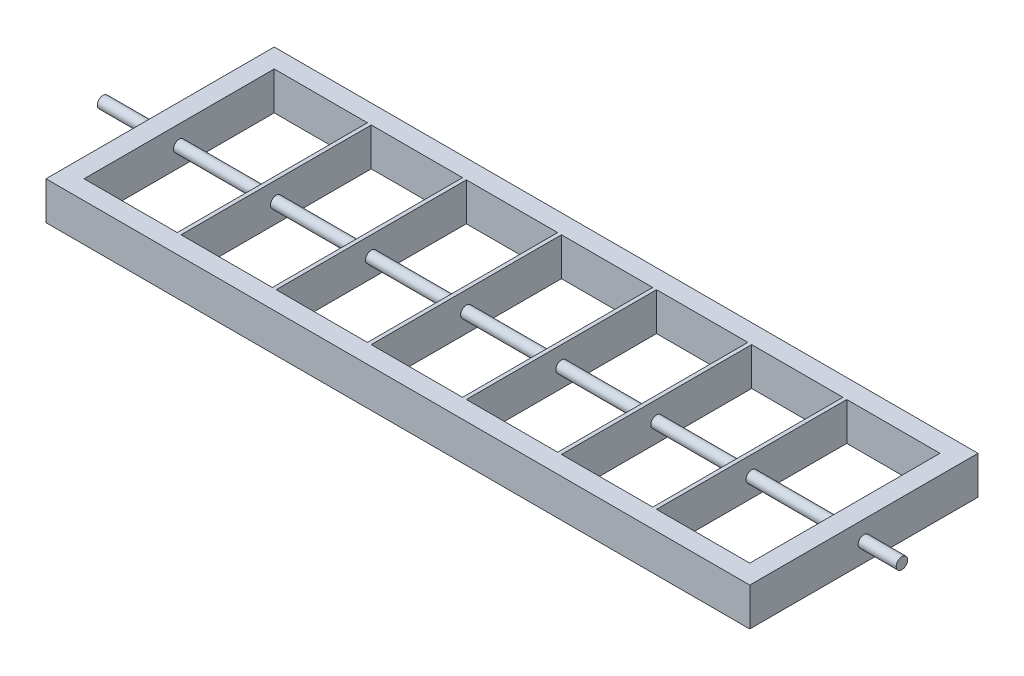
ISO-10303-21;
HEADER;
FILE_DESCRIPTION(('STEP AP214'),'2;1');
FILE_NAME('part.step','',(''),(''),'','','');
FILE_SCHEMA(('AUTOMOTIVE_DESIGN { 1 0 10303 214 1 1 1 1 }'));
ENDSEC;
DATA;
#1=APPLICATION_CONTEXT('core data for automotive mechanical design processes');
#2=APPLICATION_PROTOCOL_DEFINITION('international standard','automotive_design',2000,#1);
#3=PRODUCT_CONTEXT('',#1,'mechanical');
#4=PRODUCT('Part','Part','',(#3));
#5=PRODUCT_RELATED_PRODUCT_CATEGORY('part','',(#4));
#6=PRODUCT_DEFINITION_FORMATION('','',#4);
#7=PRODUCT_DEFINITION_CONTEXT('part definition',#1,'design');
#8=PRODUCT_DEFINITION('design','',#6,#7);
#9=PRODUCT_DEFINITION_SHAPE('','',#8);
#10=(LENGTH_UNIT() NAMED_UNIT(*) SI_UNIT(.MILLI.,.METRE.));
#11=(NAMED_UNIT(*) PLANE_ANGLE_UNIT() SI_UNIT($,.RADIAN.));
#12=(NAMED_UNIT(*) SI_UNIT($,.STERADIAN.) SOLID_ANGLE_UNIT());
#13=UNCERTAINTY_MEASURE_WITH_UNIT(LENGTH_MEASURE(1.E-05),#10,'distance_accuracy_value','');
#14=(GEOMETRIC_REPRESENTATION_CONTEXT(3) GLOBAL_UNCERTAINTY_ASSIGNED_CONTEXT((#13)) GLOBAL_UNIT_ASSIGNED_CONTEXT((#10,
#11,#12)) REPRESENTATION_CONTEXT('',''));
#15=CARTESIAN_POINT('',(0.,0.,0.));
#16=DIRECTION('',(0.,0.,1.));
#17=DIRECTION('',(1.,0.,0.));
#18=AXIS2_PLACEMENT_3D('',#15,#16,#17);
#19=CARTESIAN_POINT('',(-175.,20.,50.));
#20=DIRECTION('',(0.,0.,-1.));
#21=DIRECTION('',(-1.,0.,0.));
#22=AXIS2_PLACEMENT_3D('',#19,#20,#21);
#23=PLANE('',#22);
#24=DIRECTION('',(1.,0.,0.));
#25=VECTOR('',#24,1.);
#26=CARTESIAN_POINT('',(-175.,0.,50.));
#27=LINE('',#26,#25);
#28=CARTESIAN_POINT('',(-124.,0.,50.));
#29=VERTEX_POINT('',#28);
#30=CARTESIAN_POINT('',(-76.,0.,50.));
#31=VERTEX_POINT('',#30);
#32=EDGE_CURVE('E56',#29,#31,#27,.T.);
#33=ORIENTED_EDGE('',*,*,#32,.F.);
#34=DIRECTION('',(0.,-1.,0.));
#35=VECTOR('',#34,1.);
#36=CARTESIAN_POINT('',(-124.,0.,50.));
#37=LINE('',#36,#35);
#38=CARTESIAN_POINT('',(-124.,20.,50.));
#39=VERTEX_POINT('',#38);
#40=EDGE_CURVE('E51',#39,#29,#37,.T.);
#41=ORIENTED_EDGE('',*,*,#40,.F.);
#42=DIRECTION('',(1.,0.,0.));
#43=VECTOR('',#42,1.);
#44=CARTESIAN_POINT('',(-175.,20.,50.));
#45=LINE('',#44,#43);
#46=CARTESIAN_POINT('',(-76.,20.,50.));
#47=VERTEX_POINT('',#46);
#48=EDGE_CURVE('E255',#39,#47,#45,.T.);
#49=ORIENTED_EDGE('',*,*,#48,.T.);
#50=DIRECTION('',(0.,-1.,0.));
#51=VECTOR('',#50,1.);
#52=CARTESIAN_POINT('',(-76.,0.,50.));
#53=LINE('',#52,#51);
#54=EDGE_CURVE('E290',#47,#31,#53,.T.);
#55=ORIENTED_EDGE('',*,*,#54,.T.);
#56=EDGE_LOOP('',(#33,#41,#49,#55));
#57=FACE_BOUND('',#56,.T.);
#58=ADVANCED_FACE('F35',(#57),#23,.T.);
#59=CARTESIAN_POINT('',(-175.,20.,-50.));
#60=DIRECTION('',(0.,0.,1.));
#61=DIRECTION('',(1.,0.,0.));
#62=AXIS2_PLACEMENT_3D('',#59,#60,#61);
#63=PLANE('',#62);
#64=DIRECTION('',(-1.,0.,0.));
#65=VECTOR('',#64,1.);
#66=CARTESIAN_POINT('',(-175.,20.,-50.));
#67=LINE('',#66,#65);
#68=CARTESIAN_POINT('',(-76.,20.,-50.));
#69=VERTEX_POINT('',#68);
#70=CARTESIAN_POINT('',(-124.,20.,-50.));
#71=VERTEX_POINT('',#70);
#72=EDGE_CURVE('E538',#69,#71,#67,.T.);
#73=ORIENTED_EDGE('',*,*,#72,.T.);
#74=DIRECTION('',(0.,1.,0.));
#75=VECTOR('',#74,1.);
#76=CARTESIAN_POINT('',(-124.,0.,-50.));
#77=LINE('',#76,#75);
#78=CARTESIAN_POINT('',(-124.,0.,-50.));
#79=VERTEX_POINT('',#78);
#80=EDGE_CURVE('E265',#79,#71,#77,.T.);
#81=ORIENTED_EDGE('',*,*,#80,.F.);
#82=DIRECTION('',(-1.,0.,0.));
#83=VECTOR('',#82,1.);
#84=CARTESIAN_POINT('',(-175.,0.,-50.));
#85=LINE('',#84,#83);
#86=CARTESIAN_POINT('',(-76.,0.,-50.));
#87=VERTEX_POINT('',#86);
#88=EDGE_CURVE('E524',#87,#79,#85,.T.);
#89=ORIENTED_EDGE('',*,*,#88,.F.);
#90=DIRECTION('',(0.,1.,0.));
#91=VECTOR('',#90,1.);
#92=CARTESIAN_POINT('',(-76.,0.,-50.));
#93=LINE('',#92,#91);
#94=EDGE_CURVE('E286',#87,#69,#93,.T.);
#95=ORIENTED_EDGE('',*,*,#94,.T.);
#96=EDGE_LOOP('',(#73,#81,#89,#95));
#97=FACE_BOUND('',#96,.T.);
#98=ADVANCED_FACE('F611',(#97),#63,.T.);
#99=CARTESIAN_POINT('',(205.,10.,0.));
#100=DIRECTION('',(-1.,0.,0.));
#101=DIRECTION('',(0.,0.,1.));
#102=AXIS2_PLACEMENT_3D('',#99,#100,#101);
#103=CYLINDRICAL_SURFACE('',#102,3.);
#104=CARTESIAN_POINT('',(-76.,10.,0.));
#105=DIRECTION('',(-1.,0.,0.));
#106=DIRECTION('',(0.,0.,1.));
#107=AXIS2_PLACEMENT_3D('',#104,#105,#106);
#108=CIRCLE('',#107,3.);
#109=CARTESIAN_POINT('',(-76.,10.,3.));
#110=VERTEX_POINT('',#109);
#111=EDGE_CURVE('E44',#110,#110,#108,.F.);
#112=ORIENTED_EDGE('',*,*,#111,.F.);
#113=EDGE_LOOP('',(#112));
#114=FACE_BOUND('',#113,.T.);
#115=CARTESIAN_POINT('',(-124.,10.,0.));
#116=DIRECTION('',(-1.,0.,0.));
#117=DIRECTION('',(0.,0.,1.));
#118=AXIS2_PLACEMENT_3D('',#115,#116,#117);
#119=CIRCLE('',#118,3.);
#120=CARTESIAN_POINT('',(-124.,10.,3.));
#121=VERTEX_POINT('',#120);
#122=EDGE_CURVE('E39',#121,#121,#119,.F.);
#123=ORIENTED_EDGE('',*,*,#122,.T.);
#124=EDGE_LOOP('',(#123));
#125=FACE_BOUND('',#124,.T.);
#126=ADVANCED_FACE('F620',(#114,#125),#103,.T.);
#127=CARTESIAN_POINT('',(-74.,0.,50.));
#128=VERTEX_POINT('',#127);
#129=CARTESIAN_POINT('',(-26.,0.,50.));
#130=VERTEX_POINT('',#129);
#131=EDGE_CURVE('E519',#128,#130,#27,.T.);
#132=ORIENTED_EDGE('',*,*,#131,.F.);
#133=DIRECTION('',(0.,-1.,0.));
#134=VECTOR('',#133,1.);
#135=CARTESIAN_POINT('',(-74.,0.,50.));
#136=LINE('',#135,#134);
#137=CARTESIAN_POINT('',(-74.,20.,50.));
#138=VERTEX_POINT('',#137);
#139=EDGE_CURVE('E292',#138,#128,#136,.T.);
#140=ORIENTED_EDGE('',*,*,#139,.F.);
#141=CARTESIAN_POINT('',(-26.,20.,50.));
#142=VERTEX_POINT('',#141);
#143=EDGE_CURVE('E587',#138,#142,#45,.T.);
#144=ORIENTED_EDGE('',*,*,#143,.T.);
#145=DIRECTION('',(0.,-1.,0.));
#146=VECTOR('',#145,1.);
#147=CARTESIAN_POINT('',(-26.,0.,50.));
#148=LINE('',#147,#146);
#149=EDGE_CURVE('E313',#142,#130,#148,.T.);
#150=ORIENTED_EDGE('',*,*,#149,.T.);
#151=EDGE_LOOP('',(#132,#140,#144,#150));
#152=FACE_BOUND('',#151,.T.);
#153=ADVANCED_FACE('F634',(#152),#23,.T.);
#154=CARTESIAN_POINT('',(-26.,20.,-50.));
#155=VERTEX_POINT('',#154);
#156=CARTESIAN_POINT('',(-74.,20.,-50.));
#157=VERTEX_POINT('',#156);
#158=EDGE_CURVE('E539',#155,#157,#67,.T.);
#159=ORIENTED_EDGE('',*,*,#158,.T.);
#160=DIRECTION('',(0.,1.,0.));
#161=VECTOR('',#160,1.);
#162=CARTESIAN_POINT('',(-74.,0.,-50.));
#163=LINE('',#162,#161);
#164=CARTESIAN_POINT('',(-74.,0.,-50.));
#165=VERTEX_POINT('',#164);
#166=EDGE_CURVE('E283',#165,#157,#163,.T.);
#167=ORIENTED_EDGE('',*,*,#166,.F.);
#168=CARTESIAN_POINT('',(-26.,0.,-50.));
#169=VERTEX_POINT('',#168);
#170=EDGE_CURVE('E520',#169,#165,#85,.T.);
#171=ORIENTED_EDGE('',*,*,#170,.F.);
#172=DIRECTION('',(0.,1.,0.));
#173=VECTOR('',#172,1.);
#174=CARTESIAN_POINT('',(-26.,0.,-50.));
#175=LINE('',#174,#173);
#176=EDGE_CURVE('E309',#169,#155,#175,.T.);
#177=ORIENTED_EDGE('',*,*,#176,.T.);
#178=EDGE_LOOP('',(#159,#167,#171,#177));
#179=FACE_BOUND('',#178,.T.);
#180=ADVANCED_FACE('F639',(#179),#63,.T.);
#181=CARTESIAN_POINT('',(-26.,10.,0.));
#182=DIRECTION('',(-1.,0.,0.));
#183=DIRECTION('',(0.,0.,1.));
#184=AXIS2_PLACEMENT_3D('',#181,#182,#183);
#185=CIRCLE('',#184,3.);
#186=CARTESIAN_POINT('',(-26.,10.,3.));
#187=VERTEX_POINT('',#186);
#188=EDGE_CURVE('E493',#187,#187,#185,.F.);
#189=ORIENTED_EDGE('',*,*,#188,.F.);
#190=EDGE_LOOP('',(#189));
#191=FACE_BOUND('',#190,.T.);
#192=CARTESIAN_POINT('',(-74.,10.,0.));
#193=DIRECTION('',(-1.,0.,0.));
#194=DIRECTION('',(0.,0.,1.));
#195=AXIS2_PLACEMENT_3D('',#192,#193,#194);
#196=CIRCLE('',#195,3.);
#197=CARTESIAN_POINT('',(-74.,10.,3.));
#198=VERTEX_POINT('',#197);
#199=EDGE_CURVE('E289',#198,#198,#196,.F.);
#200=ORIENTED_EDGE('',*,*,#199,.T.);
#201=EDGE_LOOP('',(#200));
#202=FACE_BOUND('',#201,.T.);
#203=ADVANCED_FACE('F505',(#191,#202),#103,.T.);
#204=CARTESIAN_POINT('',(-24.,0.,50.));
#205=VERTEX_POINT('',#204);
#206=CARTESIAN_POINT('',(24.,0.,50.));
#207=VERTEX_POINT('',#206);
#208=EDGE_CURVE('E605',#205,#207,#27,.T.);
#209=ORIENTED_EDGE('',*,*,#208,.F.);
#210=DIRECTION('',(0.,-1.,0.));
#211=VECTOR('',#210,1.);
#212=CARTESIAN_POINT('',(-24.,0.,50.));
#213=LINE('',#212,#211);
#214=CARTESIAN_POINT('',(-24.,20.,50.));
#215=VERTEX_POINT('',#214);
#216=EDGE_CURVE('E316',#215,#205,#213,.T.);
#217=ORIENTED_EDGE('',*,*,#216,.F.);
#218=CARTESIAN_POINT('',(24.,20.,50.));
#219=VERTEX_POINT('',#218);
#220=EDGE_CURVE('E586',#215,#219,#45,.T.);
#221=ORIENTED_EDGE('',*,*,#220,.T.);
#222=DIRECTION('',(0.,-1.,0.));
#223=VECTOR('',#222,1.);
#224=CARTESIAN_POINT('',(24.,0.,50.));
#225=LINE('',#224,#223);
#226=EDGE_CURVE('E337',#219,#207,#225,.T.);
#227=ORIENTED_EDGE('',*,*,#226,.T.);
#228=EDGE_LOOP('',(#209,#217,#221,#227));
#229=FACE_BOUND('',#228,.T.);
#230=ADVANCED_FACE('F644',(#229),#23,.T.);
#231=CARTESIAN_POINT('',(24.,20.,-50.));
#232=VERTEX_POINT('',#231);
#233=CARTESIAN_POINT('',(-24.,20.,-50.));
#234=VERTEX_POINT('',#233);
#235=EDGE_CURVE('E543',#232,#234,#67,.T.);
#236=ORIENTED_EDGE('',*,*,#235,.T.);
#237=DIRECTION('',(0.,1.,0.));
#238=VECTOR('',#237,1.);
#239=CARTESIAN_POINT('',(-24.,0.,-50.));
#240=LINE('',#239,#238);
#241=CARTESIAN_POINT('',(-24.,0.,-50.));
#242=VERTEX_POINT('',#241);
#243=EDGE_CURVE('E306',#242,#234,#240,.T.);
#244=ORIENTED_EDGE('',*,*,#243,.F.);
#245=CARTESIAN_POINT('',(24.,0.,-50.));
#246=VERTEX_POINT('',#245);
#247=EDGE_CURVE('E523',#246,#242,#85,.T.);
#248=ORIENTED_EDGE('',*,*,#247,.F.);
#249=DIRECTION('',(0.,1.,0.));
#250=VECTOR('',#249,1.);
#251=CARTESIAN_POINT('',(24.,0.,-50.));
#252=LINE('',#251,#250);
#253=EDGE_CURVE('E333',#246,#232,#252,.T.);
#254=ORIENTED_EDGE('',*,*,#253,.T.);
#255=EDGE_LOOP('',(#236,#244,#248,#254));
#256=FACE_BOUND('',#255,.T.);
#257=ADVANCED_FACE('F677',(#256),#63,.T.);
#258=CARTESIAN_POINT('',(24.,10.,0.));
#259=DIRECTION('',(-1.,0.,0.));
#260=DIRECTION('',(0.,0.,1.));
#261=AXIS2_PLACEMENT_3D('',#258,#259,#260);
#262=CIRCLE('',#261,3.);
#263=CARTESIAN_POINT('',(24.,10.,3.));
#264=VERTEX_POINT('',#263);
#265=EDGE_CURVE('E488',#264,#264,#262,.F.);
#266=ORIENTED_EDGE('',*,*,#265,.F.);
#267=EDGE_LOOP('',(#266));
#268=FACE_BOUND('',#267,.T.);
#269=CARTESIAN_POINT('',(-24.,10.,0.));
#270=DIRECTION('',(-1.,0.,0.));
#271=DIRECTION('',(0.,0.,1.));
#272=AXIS2_PLACEMENT_3D('',#269,#270,#271);
#273=CIRCLE('',#272,3.);
#274=CARTESIAN_POINT('',(-24.,10.,3.));
#275=VERTEX_POINT('',#274);
#276=EDGE_CURVE('E312',#275,#275,#273,.F.);
#277=ORIENTED_EDGE('',*,*,#276,.T.);
#278=EDGE_LOOP('',(#277));
#279=FACE_BOUND('',#278,.T.);
#280=ADVANCED_FACE('F671',(#268,#279),#103,.T.);
#281=CARTESIAN_POINT('',(26.,0.,50.));
#282=VERTEX_POINT('',#281);
#283=CARTESIAN_POINT('',(74.,0.,50.));
#284=VERTEX_POINT('',#283);
#285=EDGE_CURVE('E582',#282,#284,#27,.T.);
#286=ORIENTED_EDGE('',*,*,#285,.F.);
#287=DIRECTION('',(0.,-1.,0.));
#288=VECTOR('',#287,1.);
#289=CARTESIAN_POINT('',(26.,0.,50.));
#290=LINE('',#289,#288);
#291=CARTESIAN_POINT('',(26.,20.,50.));
#292=VERTEX_POINT('',#291);
#293=EDGE_CURVE('E340',#292,#282,#290,.T.);
#294=ORIENTED_EDGE('',*,*,#293,.F.);
#295=CARTESIAN_POINT('',(74.,20.,50.));
#296=VERTEX_POINT('',#295);
#297=EDGE_CURVE('E581',#292,#296,#45,.T.);
#298=ORIENTED_EDGE('',*,*,#297,.T.);
#299=DIRECTION('',(0.,-1.,0.));
#300=VECTOR('',#299,1.);
#301=CARTESIAN_POINT('',(74.,0.,50.));
#302=LINE('',#301,#300);
#303=EDGE_CURVE('E361',#296,#284,#302,.T.);
#304=ORIENTED_EDGE('',*,*,#303,.T.);
#305=EDGE_LOOP('',(#286,#294,#298,#304));
#306=FACE_BOUND('',#305,.T.);
#307=ADVANCED_FACE('F580',(#306),#23,.T.);
#308=CARTESIAN_POINT('',(74.,20.,-50.));
#309=VERTEX_POINT('',#308);
#310=CARTESIAN_POINT('',(26.,20.,-50.));
#311=VERTEX_POINT('',#310);
#312=EDGE_CURVE('E546',#309,#311,#67,.T.);
#313=ORIENTED_EDGE('',*,*,#312,.T.);
#314=DIRECTION('',(0.,1.,0.));
#315=VECTOR('',#314,1.);
#316=CARTESIAN_POINT('',(26.,0.,-50.));
#317=LINE('',#316,#315);
#318=CARTESIAN_POINT('',(26.,0.,-50.));
#319=VERTEX_POINT('',#318);
#320=EDGE_CURVE('E330',#319,#311,#317,.T.);
#321=ORIENTED_EDGE('',*,*,#320,.F.);
#322=CARTESIAN_POINT('',(74.,0.,-50.));
#323=VERTEX_POINT('',#322);
#324=EDGE_CURVE('E526',#323,#319,#85,.T.);
#325=ORIENTED_EDGE('',*,*,#324,.F.);
#326=DIRECTION('',(0.,1.,0.));
#327=VECTOR('',#326,1.);
#328=CARTESIAN_POINT('',(74.,0.,-50.));
#329=LINE('',#328,#327);
#330=EDGE_CURVE('E357',#323,#309,#329,.T.);
#331=ORIENTED_EDGE('',*,*,#330,.T.);
#332=EDGE_LOOP('',(#313,#321,#325,#331));
#333=FACE_BOUND('',#332,.T.);
#334=ADVANCED_FACE('F669',(#333),#63,.T.);
#335=CARTESIAN_POINT('',(74.,10.,0.));
#336=DIRECTION('',(-1.,0.,0.));
#337=DIRECTION('',(0.,0.,1.));
#338=AXIS2_PLACEMENT_3D('',#335,#336,#337);
#339=CIRCLE('',#338,3.);
#340=CARTESIAN_POINT('',(74.,10.,3.));
#341=VERTEX_POINT('',#340);
#342=EDGE_CURVE('E483',#341,#341,#339,.F.);
#343=ORIENTED_EDGE('',*,*,#342,.F.);
#344=EDGE_LOOP('',(#343));
#345=FACE_BOUND('',#344,.T.);
#346=CARTESIAN_POINT('',(26.,10.,0.));
#347=DIRECTION('',(-1.,0.,0.));
#348=DIRECTION('',(0.,0.,1.));
#349=AXIS2_PLACEMENT_3D('',#346,#347,#348);
#350=CIRCLE('',#349,3.);
#351=CARTESIAN_POINT('',(26.,10.,3.));
#352=VERTEX_POINT('',#351);
#353=EDGE_CURVE('E336',#352,#352,#350,.F.);
#354=ORIENTED_EDGE('',*,*,#353,.T.);
#355=EDGE_LOOP('',(#354));
#356=FACE_BOUND('',#355,.T.);
#357=ADVANCED_FACE('F663',(#345,#356),#103,.T.);
#358=CARTESIAN_POINT('',(76.,0.,50.));
#359=VERTEX_POINT('',#358);
#360=CARTESIAN_POINT('',(124.,0.,50.));
#361=VERTEX_POINT('',#360);
#362=EDGE_CURVE('E570',#359,#361,#27,.T.);
#363=ORIENTED_EDGE('',*,*,#362,.F.);
#364=DIRECTION('',(0.,-1.,0.));
#365=VECTOR('',#364,1.);
#366=CARTESIAN_POINT('',(76.,0.,50.));
#367=LINE('',#366,#365);
#368=CARTESIAN_POINT('',(76.,20.,50.));
#369=VERTEX_POINT('',#368);
#370=EDGE_CURVE('E364',#369,#359,#367,.T.);
#371=ORIENTED_EDGE('',*,*,#370,.F.);
#372=CARTESIAN_POINT('',(124.,20.,50.));
#373=VERTEX_POINT('',#372);
#374=EDGE_CURVE('E563',#369,#373,#45,.T.);
#375=ORIENTED_EDGE('',*,*,#374,.T.);
#376=DIRECTION('',(0.,-1.,0.));
#377=VECTOR('',#376,1.);
#378=CARTESIAN_POINT('',(124.,0.,50.));
#379=LINE('',#378,#377);
#380=EDGE_CURVE('E385',#373,#361,#379,.T.);
#381=ORIENTED_EDGE('',*,*,#380,.T.);
#382=EDGE_LOOP('',(#363,#371,#375,#381));
#383=FACE_BOUND('',#382,.T.);
#384=ADVANCED_FACE('F655',(#383),#23,.T.);
#385=CARTESIAN_POINT('',(124.,20.,-50.));
#386=VERTEX_POINT('',#385);
#387=CARTESIAN_POINT('',(76.,20.,-50.));
#388=VERTEX_POINT('',#387);
#389=EDGE_CURVE('E428',#386,#388,#67,.T.);
#390=ORIENTED_EDGE('',*,*,#389,.T.);
#391=DIRECTION('',(0.,1.,0.));
#392=VECTOR('',#391,1.);
#393=CARTESIAN_POINT('',(76.,0.,-50.));
#394=LINE('',#393,#392);
#395=CARTESIAN_POINT('',(76.,0.,-50.));
#396=VERTEX_POINT('',#395);
#397=EDGE_CURVE('E354',#396,#388,#394,.T.);
#398=ORIENTED_EDGE('',*,*,#397,.F.);
#399=CARTESIAN_POINT('',(124.,0.,-50.));
#400=VERTEX_POINT('',#399);
#401=EDGE_CURVE('E440',#400,#396,#85,.T.);
#402=ORIENTED_EDGE('',*,*,#401,.F.);
#403=DIRECTION('',(0.,1.,0.));
#404=VECTOR('',#403,1.);
#405=CARTESIAN_POINT('',(124.,0.,-50.));
#406=LINE('',#405,#404);
#407=EDGE_CURVE('E381',#400,#386,#406,.T.);
#408=ORIENTED_EDGE('',*,*,#407,.T.);
#409=EDGE_LOOP('',(#390,#398,#402,#408));
#410=FACE_BOUND('',#409,.T.);
#411=ADVANCED_FACE('F556',(#410),#63,.T.);
#412=CARTESIAN_POINT('',(124.,10.,0.));
#413=DIRECTION('',(-1.,0.,0.));
#414=DIRECTION('',(0.,0.,1.));
#415=AXIS2_PLACEMENT_3D('',#412,#413,#414);
#416=CIRCLE('',#415,3.);
#417=CARTESIAN_POINT('',(124.,10.,3.));
#418=VERTEX_POINT('',#417);
#419=EDGE_CURVE('E412',#418,#418,#416,.F.);
#420=ORIENTED_EDGE('',*,*,#419,.F.);
#421=EDGE_LOOP('',(#420));
#422=FACE_BOUND('',#421,.T.);
#423=CARTESIAN_POINT('',(76.,10.,0.));
#424=DIRECTION('',(-1.,0.,0.));
#425=DIRECTION('',(0.,0.,1.));
#426=AXIS2_PLACEMENT_3D('',#423,#424,#425);
#427=CIRCLE('',#426,3.);
#428=CARTESIAN_POINT('',(76.,10.,3.));
#429=VERTEX_POINT('',#428);
#430=EDGE_CURVE('E360',#429,#429,#427,.F.);
#431=ORIENTED_EDGE('',*,*,#430,.T.);
#432=EDGE_LOOP('',(#431));
#433=FACE_BOUND('',#432,.T.);
#434=ADVANCED_FACE('F654',(#422,#433),#103,.T.);
#435=CARTESIAN_POINT('',(126.,0.,50.));
#436=VERTEX_POINT('',#435);
#437=CARTESIAN_POINT('',(175.,0.,50.));
#438=VERTEX_POINT('',#437);
#439=EDGE_CURVE('E431',#436,#438,#27,.T.);
#440=ORIENTED_EDGE('',*,*,#439,.F.);
#441=DIRECTION('',(0.,-1.,0.));
#442=VECTOR('',#441,1.);
#443=CARTESIAN_POINT('',(126.,0.,50.));
#444=LINE('',#443,#442);
#445=CARTESIAN_POINT('',(126.,20.,50.));
#446=VERTEX_POINT('',#445);
#447=EDGE_CURVE('E388',#446,#436,#444,.T.);
#448=ORIENTED_EDGE('',*,*,#447,.F.);
#449=CARTESIAN_POINT('',(175.,20.,50.));
#450=VERTEX_POINT('',#449);
#451=EDGE_CURVE('E257',#446,#450,#45,.T.);
#452=ORIENTED_EDGE('',*,*,#451,.T.);
#453=DIRECTION('',(0.,-1.,0.));
#454=VECTOR('',#453,1.);
#455=CARTESIAN_POINT('',(175.,20.,50.));
#456=LINE('',#455,#454);
#457=EDGE_CURVE('E445',#450,#438,#456,.T.);
#458=ORIENTED_EDGE('',*,*,#457,.T.);
#459=EDGE_LOOP('',(#440,#448,#452,#458));
#460=FACE_BOUND('',#459,.T.);
#461=ADVANCED_FACE('F592',(#460),#23,.T.);
#462=CARTESIAN_POINT('',(175.,20.,-50.));
#463=VERTEX_POINT('',#462);
#464=CARTESIAN_POINT('',(126.,20.,-50.));
#465=VERTEX_POINT('',#464);
#466=EDGE_CURVE('E425',#463,#465,#67,.T.);
#467=ORIENTED_EDGE('',*,*,#466,.T.);
#468=DIRECTION('',(0.,1.,0.));
#469=VECTOR('',#468,1.);
#470=CARTESIAN_POINT('',(126.,0.,-50.));
#471=LINE('',#470,#469);
#472=CARTESIAN_POINT('',(126.,0.,-50.));
#473=VERTEX_POINT('',#472);
#474=EDGE_CURVE('E378',#473,#465,#471,.T.);
#475=ORIENTED_EDGE('',*,*,#474,.F.);
#476=CARTESIAN_POINT('',(175.,0.,-50.));
#477=VERTEX_POINT('',#476);
#478=EDGE_CURVE('E421',#477,#473,#85,.T.);
#479=ORIENTED_EDGE('',*,*,#478,.F.);
#480=DIRECTION('',(0.,-1.,0.));
#481=VECTOR('',#480,1.);
#482=CARTESIAN_POINT('',(175.,20.,-50.));
#483=LINE('',#482,#481);
#484=EDGE_CURVE('E443',#463,#477,#483,.T.);
#485=ORIENTED_EDGE('',*,*,#484,.F.);
#486=EDGE_LOOP('',(#467,#475,#479,#485));
#487=FACE_BOUND('',#486,.T.);
#488=ADVANCED_FACE('F601',(#487),#63,.T.);
#489=CARTESIAN_POINT('',(175.,10.,0.));
#490=DIRECTION('',(-1.,0.,0.));
#491=DIRECTION('',(0.,0.,1.));
#492=AXIS2_PLACEMENT_3D('',#489,#490,#491);
#493=CIRCLE('',#492,3.);
#494=CARTESIAN_POINT('',(175.,10.,3.));
#495=VERTEX_POINT('',#494);
#496=EDGE_CURVE('E413',#495,#495,#493,.T.);
#497=ORIENTED_EDGE('',*,*,#496,.T.);
#498=EDGE_LOOP('',(#497));
#499=FACE_BOUND('',#498,.T.);
#500=CARTESIAN_POINT('',(126.,10.,0.));
#501=DIRECTION('',(-1.,0.,0.));
#502=DIRECTION('',(0.,0.,1.));
#503=AXIS2_PLACEMENT_3D('',#500,#501,#502);
#504=CIRCLE('',#503,3.);
#505=CARTESIAN_POINT('',(126.,10.,3.));
#506=VERTEX_POINT('',#505);
#507=EDGE_CURVE('E384',#506,#506,#504,.F.);
#508=ORIENTED_EDGE('',*,*,#507,.T.);
#509=EDGE_LOOP('',(#508));
#510=FACE_BOUND('',#509,.T.);
#511=ADVANCED_FACE('F660',(#499,#510),#103,.T.);
#512=CARTESIAN_POINT('',(0.,20.,0.));
#513=DIRECTION('',(0.,-1.,0.));
#514=DIRECTION('',(0.,0.,-1.));
#515=AXIS2_PLACEMENT_3D('',#512,#513,#514);
#516=PLANE('',#515);
#517=ORIENTED_EDGE('',*,*,#48,.F.);
#518=DIRECTION('',(0.,0.,1.));
#519=VECTOR('',#518,1.);
#520=CARTESIAN_POINT('',(-124.,20.,-70.0997512422418));
#521=LINE('',#520,#519);
#522=EDGE_CURVE('E266',#71,#39,#521,.T.);
#523=ORIENTED_EDGE('',*,*,#522,.F.);
#524=ORIENTED_EDGE('',*,*,#72,.F.);
#525=DIRECTION('',(0.,0.,1.));
#526=VECTOR('',#525,1.);
#527=CARTESIAN_POINT('',(-76.,20.,-70.0997512422418));
#528=LINE('',#527,#526);
#529=EDGE_CURVE('E287',#69,#47,#528,.T.);
#530=ORIENTED_EDGE('',*,*,#529,.T.);
#531=EDGE_LOOP('',(#517,#523,#524,#530));
#532=FACE_BOUND('',#531,.T.);
#533=ORIENTED_EDGE('',*,*,#143,.F.);
#534=DIRECTION('',(0.,0.,1.));
#535=VECTOR('',#534,1.);
#536=CARTESIAN_POINT('',(-74.,20.,-70.0997512422418));
#537=LINE('',#536,#535);
#538=EDGE_CURVE('E301',#157,#138,#537,.T.);
#539=ORIENTED_EDGE('',*,*,#538,.F.);
#540=ORIENTED_EDGE('',*,*,#158,.F.);
#541=DIRECTION('',(0.,0.,1.));
#542=VECTOR('',#541,1.);
#543=CARTESIAN_POINT('',(-26.,20.,-70.0997512422418));
#544=LINE('',#543,#542);
#545=EDGE_CURVE('E310',#155,#142,#544,.T.);
#546=ORIENTED_EDGE('',*,*,#545,.T.);
#547=EDGE_LOOP('',(#533,#539,#540,#546));
#548=FACE_BOUND('',#547,.T.);
#549=ORIENTED_EDGE('',*,*,#220,.F.);
#550=DIRECTION('',(0.,0.,1.));
#551=VECTOR('',#550,1.);
#552=CARTESIAN_POINT('',(-24.,20.,-70.0997512422418));
#553=LINE('',#552,#551);
#554=EDGE_CURVE('E325',#234,#215,#553,.T.);
#555=ORIENTED_EDGE('',*,*,#554,.F.);
#556=ORIENTED_EDGE('',*,*,#235,.F.);
#557=DIRECTION('',(0.,0.,1.));
#558=VECTOR('',#557,1.);
#559=CARTESIAN_POINT('',(24.,20.,-70.0997512422418));
#560=LINE('',#559,#558);
#561=EDGE_CURVE('E334',#232,#219,#560,.T.);
#562=ORIENTED_EDGE('',*,*,#561,.T.);
#563=EDGE_LOOP('',(#549,#555,#556,#562));
#564=FACE_BOUND('',#563,.T.);
#565=ORIENTED_EDGE('',*,*,#297,.F.);
#566=DIRECTION('',(0.,0.,1.));
#567=VECTOR('',#566,1.);
#568=CARTESIAN_POINT('',(26.,20.,-70.0997512422418));
#569=LINE('',#568,#567);
#570=EDGE_CURVE('E349',#311,#292,#569,.T.);
#571=ORIENTED_EDGE('',*,*,#570,.F.);
#572=ORIENTED_EDGE('',*,*,#312,.F.);
#573=DIRECTION('',(0.,0.,1.));
#574=VECTOR('',#573,1.);
#575=CARTESIAN_POINT('',(74.,20.,-70.0997512422418));
#576=LINE('',#575,#574);
#577=EDGE_CURVE('E358',#309,#296,#576,.T.);
#578=ORIENTED_EDGE('',*,*,#577,.T.);
#579=EDGE_LOOP('',(#565,#571,#572,#578));
#580=FACE_BOUND('',#579,.T.);
#581=ORIENTED_EDGE('',*,*,#374,.F.);
#582=DIRECTION('',(0.,0.,1.));
#583=VECTOR('',#582,1.);
#584=CARTESIAN_POINT('',(76.,20.,-70.0997512422418));
#585=LINE('',#584,#583);
#586=EDGE_CURVE('E373',#388,#369,#585,.T.);
#587=ORIENTED_EDGE('',*,*,#586,.F.);
#588=ORIENTED_EDGE('',*,*,#389,.F.);
#589=DIRECTION('',(0.,0.,1.));
#590=VECTOR('',#589,1.);
#591=CARTESIAN_POINT('',(124.,20.,-70.0997512422418));
#592=LINE('',#591,#590);
#593=EDGE_CURVE('E382',#386,#373,#592,.T.);
#594=ORIENTED_EDGE('',*,*,#593,.T.);
#595=EDGE_LOOP('',(#581,#587,#588,#594));
#596=FACE_BOUND('',#595,.T.);
#597=ORIENTED_EDGE('',*,*,#451,.F.);
#598=DIRECTION('',(0.,0.,1.));
#599=VECTOR('',#598,1.);
#600=CARTESIAN_POINT('',(126.,20.,-70.0997512422418));
#601=LINE('',#600,#599);
#602=EDGE_CURVE('E397',#465,#446,#601,.T.);
#603=ORIENTED_EDGE('',*,*,#602,.F.);
#604=ORIENTED_EDGE('',*,*,#466,.F.);
#605=DIRECTION('',(0.,0.,-1.));
#606=VECTOR('',#605,1.);
#607=CARTESIAN_POINT('',(175.,20.,50.));
#608=LINE('',#607,#606);
#609=EDGE_CURVE('E254',#450,#463,#608,.T.);
#610=ORIENTED_EDGE('',*,*,#609,.F.);
#611=EDGE_LOOP('',(#597,#603,#604,#610));
#612=FACE_BOUND('',#611,.T.);
#613=DIRECTION('',(0.,0.,-1.));
#614=VECTOR('',#613,1.);
#615=CARTESIAN_POINT('',(185.,20.,60.));
#616=LINE('',#615,#614);
#617=CARTESIAN_POINT('',(185.,20.,60.));
#618=VERTEX_POINT('',#617);
#619=CARTESIAN_POINT('',(185.,20.,-60.));
#620=VERTEX_POINT('',#619);
#621=EDGE_CURVE('E450',#618,#620,#616,.T.);
#622=ORIENTED_EDGE('',*,*,#621,.T.);
#623=DIRECTION('',(-1.,0.,0.));
#624=VECTOR('',#623,1.);
#625=CARTESIAN_POINT('',(-185.,20.,-60.));
#626=LINE('',#625,#624);
#627=CARTESIAN_POINT('',(-185.,20.,-60.));
#628=VERTEX_POINT('',#627);
#629=EDGE_CURVE('E453',#620,#628,#626,.T.);
#630=ORIENTED_EDGE('',*,*,#629,.T.);
#631=DIRECTION('',(0.,0.,1.));
#632=VECTOR('',#631,1.);
#633=CARTESIAN_POINT('',(-185.,20.,60.));
#634=LINE('',#633,#632);
#635=CARTESIAN_POINT('',(-185.,20.,60.));
#636=VERTEX_POINT('',#635);
#637=EDGE_CURVE('E456',#628,#636,#634,.T.);
#638=ORIENTED_EDGE('',*,*,#637,.T.);
#639=DIRECTION('',(1.,0.,0.));
#640=VECTOR('',#639,1.);
#641=CARTESIAN_POINT('',(-185.,20.,60.));
#642=LINE('',#641,#640);
#643=EDGE_CURVE('E458',#636,#618,#642,.T.);
#644=ORIENTED_EDGE('',*,*,#643,.T.);
#645=EDGE_LOOP('',(#622,#630,#638,#644));
#646=FACE_BOUND('',#645,.T.);
#647=DIRECTION('',(0.,0.,1.));
#648=VECTOR('',#647,1.);
#649=CARTESIAN_POINT('',(-175.,20.,50.));
#650=LINE('',#649,#648);
#651=CARTESIAN_POINT('',(-175.,20.,-50.));
#652=VERTEX_POINT('',#651);
#653=CARTESIAN_POINT('',(-175.,20.,50.));
#654=VERTEX_POINT('',#653);
#655=EDGE_CURVE('E420',#652,#654,#650,.T.);
#656=ORIENTED_EDGE('',*,*,#655,.F.);
#657=CARTESIAN_POINT('',(-126.,20.,-50.));
#658=VERTEX_POINT('',#657);
#659=EDGE_CURVE('E262',#658,#652,#67,.T.);
#660=ORIENTED_EDGE('',*,*,#659,.F.);
#661=DIRECTION('',(0.,0.,1.));
#662=VECTOR('',#661,1.);
#663=CARTESIAN_POINT('',(-126.,20.,-70.0997512422418));
#664=LINE('',#663,#662);
#665=CARTESIAN_POINT('',(-126.,20.,50.));
#666=VERTEX_POINT('',#665);
#667=EDGE_CURVE('E260',#658,#666,#664,.T.);
#668=ORIENTED_EDGE('',*,*,#667,.T.);
#669=EDGE_CURVE('E244',#654,#666,#45,.T.);
#670=ORIENTED_EDGE('',*,*,#669,.F.);
#671=EDGE_LOOP('',(#656,#660,#668,#670));
#672=FACE_BOUND('',#671,.T.);
#673=ADVANCED_FACE('F261',(#532,#548,#564,#580,#596,#612,#646,#672),#516,.F.);
#674=CARTESIAN_POINT('',(0.,0.,0.));
#675=DIRECTION('',(0.,-1.,0.));
#676=DIRECTION('',(0.,0.,-1.));
#677=AXIS2_PLACEMENT_3D('',#674,#675,#676);
#678=PLANE('',#677);
#679=CARTESIAN_POINT('',(-175.,0.,50.));
#680=VERTEX_POINT('',#679);
#681=CARTESIAN_POINT('',(-126.,0.,50.));
#682=VERTEX_POINT('',#681);
#683=EDGE_CURVE('E432',#680,#682,#27,.T.);
#684=ORIENTED_EDGE('',*,*,#683,.T.);
#685=DIRECTION('',(0.,0.,1.));
#686=VECTOR('',#685,1.);
#687=CARTESIAN_POINT('',(-126.,0.,-70.0997512422418));
#688=LINE('',#687,#686);
#689=CARTESIAN_POINT('',(-126.,0.,-50.));
#690=VERTEX_POINT('',#689);
#691=EDGE_CURVE('E271',#690,#682,#688,.T.);
#692=ORIENTED_EDGE('',*,*,#691,.F.);
#693=CARTESIAN_POINT('',(-175.,0.,-50.));
#694=VERTEX_POINT('',#693);
#695=EDGE_CURVE('E437',#690,#694,#85,.T.);
#696=ORIENTED_EDGE('',*,*,#695,.T.);
#697=DIRECTION('',(0.,0.,1.));
#698=VECTOR('',#697,1.);
#699=CARTESIAN_POINT('',(-175.,0.,50.));
#700=LINE('',#699,#698);
#701=EDGE_CURVE('E419',#694,#680,#700,.T.);
#702=ORIENTED_EDGE('',*,*,#701,.T.);
#703=EDGE_LOOP('',(#684,#692,#696,#702));
#704=FACE_BOUND('',#703,.T.);
#705=DIRECTION('',(0.,0.,1.));
#706=VECTOR('',#705,1.);
#707=CARTESIAN_POINT('',(-124.,0.,-70.0997512422418));
#708=LINE('',#707,#706);
#709=EDGE_CURVE('E279',#79,#29,#708,.T.);
#710=ORIENTED_EDGE('',*,*,#709,.T.);
#711=ORIENTED_EDGE('',*,*,#32,.T.);
#712=DIRECTION('',(0.,0.,1.));
#713=VECTOR('',#712,1.);
#714=CARTESIAN_POINT('',(-76.,0.,-70.0997512422418));
#715=LINE('',#714,#713);
#716=EDGE_CURVE('E295',#87,#31,#715,.T.);
#717=ORIENTED_EDGE('',*,*,#716,.F.);
#718=ORIENTED_EDGE('',*,*,#88,.T.);
#719=EDGE_LOOP('',(#710,#711,#717,#718));
#720=FACE_BOUND('',#719,.T.);
#721=DIRECTION('',(0.,0.,1.));
#722=VECTOR('',#721,1.);
#723=CARTESIAN_POINT('',(-74.,0.,-70.0997512422418));
#724=LINE('',#723,#722);
#725=EDGE_CURVE('E298',#165,#128,#724,.T.);
#726=ORIENTED_EDGE('',*,*,#725,.T.);
#727=ORIENTED_EDGE('',*,*,#131,.T.);
#728=DIRECTION('',(0.,0.,1.));
#729=VECTOR('',#728,1.);
#730=CARTESIAN_POINT('',(-26.,0.,-70.0997512422418));
#731=LINE('',#730,#729);
#732=EDGE_CURVE('E319',#169,#130,#731,.T.);
#733=ORIENTED_EDGE('',*,*,#732,.F.);
#734=ORIENTED_EDGE('',*,*,#170,.T.);
#735=EDGE_LOOP('',(#726,#727,#733,#734));
#736=FACE_BOUND('',#735,.T.);
#737=DIRECTION('',(0.,0.,1.));
#738=VECTOR('',#737,1.);
#739=CARTESIAN_POINT('',(-24.,0.,-70.0997512422418));
#740=LINE('',#739,#738);
#741=EDGE_CURVE('E322',#242,#205,#740,.T.);
#742=ORIENTED_EDGE('',*,*,#741,.T.);
#743=ORIENTED_EDGE('',*,*,#208,.T.);
#744=DIRECTION('',(0.,0.,1.));
#745=VECTOR('',#744,1.);
#746=CARTESIAN_POINT('',(24.,0.,-70.0997512422418));
#747=LINE('',#746,#745);
#748=EDGE_CURVE('E343',#246,#207,#747,.T.);
#749=ORIENTED_EDGE('',*,*,#748,.F.);
#750=ORIENTED_EDGE('',*,*,#247,.T.);
#751=EDGE_LOOP('',(#742,#743,#749,#750));
#752=FACE_BOUND('',#751,.T.);
#753=DIRECTION('',(0.,0.,1.));
#754=VECTOR('',#753,1.);
#755=CARTESIAN_POINT('',(26.,0.,-70.0997512422418));
#756=LINE('',#755,#754);
#757=EDGE_CURVE('E346',#319,#282,#756,.T.);
#758=ORIENTED_EDGE('',*,*,#757,.T.);
#759=ORIENTED_EDGE('',*,*,#285,.T.);
#760=DIRECTION('',(0.,0.,1.));
#761=VECTOR('',#760,1.);
#762=CARTESIAN_POINT('',(74.,0.,-70.0997512422418));
#763=LINE('',#762,#761);
#764=EDGE_CURVE('E367',#323,#284,#763,.T.);
#765=ORIENTED_EDGE('',*,*,#764,.F.);
#766=ORIENTED_EDGE('',*,*,#324,.T.);
#767=EDGE_LOOP('',(#758,#759,#765,#766));
#768=FACE_BOUND('',#767,.T.);
#769=DIRECTION('',(0.,0.,1.));
#770=VECTOR('',#769,1.);
#771=CARTESIAN_POINT('',(76.,0.,-70.0997512422418));
#772=LINE('',#771,#770);
#773=EDGE_CURVE('E370',#396,#359,#772,.T.);
#774=ORIENTED_EDGE('',*,*,#773,.T.);
#775=ORIENTED_EDGE('',*,*,#362,.T.);
#776=DIRECTION('',(0.,0.,1.));
#777=VECTOR('',#776,1.);
#778=CARTESIAN_POINT('',(124.,0.,-70.0997512422418));
#779=LINE('',#778,#777);
#780=EDGE_CURVE('E391',#400,#361,#779,.T.);
#781=ORIENTED_EDGE('',*,*,#780,.F.);
#782=ORIENTED_EDGE('',*,*,#401,.T.);
#783=EDGE_LOOP('',(#774,#775,#781,#782));
#784=FACE_BOUND('',#783,.T.);
#785=DIRECTION('',(0.,0.,-1.));
#786=VECTOR('',#785,1.);
#787=CARTESIAN_POINT('',(185.,0.,60.));
#788=LINE('',#787,#786);
#789=CARTESIAN_POINT('',(185.,0.,60.));
#790=VERTEX_POINT('',#789);
#791=CARTESIAN_POINT('',(185.,0.,-60.));
#792=VERTEX_POINT('',#791);
#793=EDGE_CURVE('E449',#790,#792,#788,.T.);
#794=ORIENTED_EDGE('',*,*,#793,.F.);
#795=DIRECTION('',(1.,0.,0.));
#796=VECTOR('',#795,1.);
#797=CARTESIAN_POINT('',(-185.,0.,60.));
#798=LINE('',#797,#796);
#799=CARTESIAN_POINT('',(-185.,0.,60.));
#800=VERTEX_POINT('',#799);
#801=EDGE_CURVE('E454',#800,#790,#798,.T.);
#802=ORIENTED_EDGE('',*,*,#801,.F.);
#803=DIRECTION('',(0.,0.,1.));
#804=VECTOR('',#803,1.);
#805=CARTESIAN_POINT('',(-185.,0.,60.));
#806=LINE('',#805,#804);
#807=CARTESIAN_POINT('',(-185.,0.,-60.));
#808=VERTEX_POINT('',#807);
#809=EDGE_CURVE('E465',#808,#800,#806,.T.);
#810=ORIENTED_EDGE('',*,*,#809,.F.);
#811=DIRECTION('',(-1.,0.,0.));
#812=VECTOR('',#811,1.);
#813=CARTESIAN_POINT('',(-185.,0.,-60.));
#814=LINE('',#813,#812);
#815=EDGE_CURVE('E463',#792,#808,#814,.T.);
#816=ORIENTED_EDGE('',*,*,#815,.F.);
#817=EDGE_LOOP('',(#794,#802,#810,#816));
#818=FACE_BOUND('',#817,.T.);
#819=ORIENTED_EDGE('',*,*,#478,.T.);
#820=DIRECTION('',(0.,0.,1.));
#821=VECTOR('',#820,1.);
#822=CARTESIAN_POINT('',(126.,0.,-70.0997512422418));
#823=LINE('',#822,#821);
#824=EDGE_CURVE('E394',#473,#436,#823,.T.);
#825=ORIENTED_EDGE('',*,*,#824,.T.);
#826=ORIENTED_EDGE('',*,*,#439,.T.);
#827=DIRECTION('',(0.,0.,-1.));
#828=VECTOR('',#827,1.);
#829=CARTESIAN_POINT('',(175.,0.,50.));
#830=LINE('',#829,#828);
#831=EDGE_CURVE('E434',#438,#477,#830,.T.);
#832=ORIENTED_EDGE('',*,*,#831,.T.);
#833=EDGE_LOOP('',(#819,#825,#826,#832));
#834=FACE_BOUND('',#833,.T.);
#835=ADVANCED_FACE('F516',(#704,#720,#736,#752,#768,#784,#818,#834),#678,.T.);
#836=CARTESIAN_POINT('',(185.,20.,60.));
#837=DIRECTION('',(-1.,0.,0.));
#838=DIRECTION('',(0.,0.,1.));
#839=AXIS2_PLACEMENT_3D('',#836,#837,#838);
#840=PLANE('',#839);
#841=CARTESIAN_POINT('',(185.,10.,0.));
#842=DIRECTION('',(-1.,0.,0.));
#843=DIRECTION('',(0.,0.,1.));
#844=AXIS2_PLACEMENT_3D('',#841,#842,#843);
#845=CIRCLE('',#844,3.);
#846=CARTESIAN_POINT('',(185.,10.,3.));
#847=VERTEX_POINT('',#846);
#848=EDGE_CURVE('E416',#847,#847,#845,.T.);
#849=ORIENTED_EDGE('',*,*,#848,.T.);
#850=EDGE_LOOP('',(#849));
#851=FACE_BOUND('',#850,.T.);
#852=ORIENTED_EDGE('',*,*,#793,.T.);
#853=DIRECTION('',(0.,-1.,0.));
#854=VECTOR('',#853,1.);
#855=CARTESIAN_POINT('',(185.,20.,-60.));
#856=LINE('',#855,#854);
#857=EDGE_CURVE('E476',#620,#792,#856,.T.);
#858=ORIENTED_EDGE('',*,*,#857,.F.);
#859=ORIENTED_EDGE('',*,*,#621,.F.);
#860=DIRECTION('',(0.,-1.,0.));
#861=VECTOR('',#860,1.);
#862=CARTESIAN_POINT('',(185.,20.,60.));
#863=LINE('',#862,#861);
#864=EDGE_CURVE('E460',#618,#790,#863,.T.);
#865=ORIENTED_EDGE('',*,*,#864,.T.);
#866=EDGE_LOOP('',(#852,#858,#859,#865));
#867=FACE_BOUND('',#866,.T.);
#868=ADVANCED_FACE('F37',(#851,#867),#840,.F.);
#869=CARTESIAN_POINT('',(-185.,20.,-60.));
#870=DIRECTION('',(0.,0.,1.));
#871=DIRECTION('',(1.,0.,0.));
#872=AXIS2_PLACEMENT_3D('',#869,#870,#871);
#873=PLANE('',#872);
#874=ORIENTED_EDGE('',*,*,#815,.T.);
#875=DIRECTION('',(0.,-1.,0.));
#876=VECTOR('',#875,1.);
#877=CARTESIAN_POINT('',(-185.,20.,-60.));
#878=LINE('',#877,#876);
#879=EDGE_CURVE('E473',#628,#808,#878,.T.);
#880=ORIENTED_EDGE('',*,*,#879,.F.);
#881=ORIENTED_EDGE('',*,*,#629,.F.);
#882=ORIENTED_EDGE('',*,*,#857,.T.);
#883=EDGE_LOOP('',(#874,#880,#881,#882));
#884=FACE_BOUND('',#883,.T.);
#885=ADVANCED_FACE('F848',(#884),#873,.F.);
#886=CARTESIAN_POINT('',(-185.,20.,60.));
#887=DIRECTION('',(1.,0.,0.));
#888=DIRECTION('',(0.,0.,-1.));
#889=AXIS2_PLACEMENT_3D('',#886,#887,#888);
#890=PLANE('',#889);
#891=CARTESIAN_POINT('',(-185.,10.,0.));
#892=DIRECTION('',(1.,0.,0.));
#893=DIRECTION('',(0.,0.,-1.));
#894=AXIS2_PLACEMENT_3D('',#891,#892,#893);
#895=CIRCLE('',#894,3.);
#896=CARTESIAN_POINT('',(-185.,10.,-3.));
#897=VERTEX_POINT('',#896);
#898=EDGE_CURVE('E408',#897,#897,#895,.T.);
#899=ORIENTED_EDGE('',*,*,#898,.T.);
#900=EDGE_LOOP('',(#899));
#901=FACE_BOUND('',#900,.T.);
#902=ORIENTED_EDGE('',*,*,#809,.T.);
#903=DIRECTION('',(0.,-1.,0.));
#904=VECTOR('',#903,1.);
#905=CARTESIAN_POINT('',(-185.,20.,60.));
#906=LINE('',#905,#904);
#907=EDGE_CURVE('E470',#636,#800,#906,.T.);
#908=ORIENTED_EDGE('',*,*,#907,.F.);
#909=ORIENTED_EDGE('',*,*,#637,.F.);
#910=ORIENTED_EDGE('',*,*,#879,.T.);
#911=EDGE_LOOP('',(#902,#908,#909,#910));
#912=FACE_BOUND('',#911,.T.);
#913=ADVANCED_FACE('F845',(#901,#912),#890,.F.);
#914=CARTESIAN_POINT('',(-185.,20.,60.));
#915=DIRECTION('',(0.,0.,-1.));
#916=DIRECTION('',(-1.,0.,0.));
#917=AXIS2_PLACEMENT_3D('',#914,#915,#916);
#918=PLANE('',#917);
#919=ORIENTED_EDGE('',*,*,#801,.T.);
#920=ORIENTED_EDGE('',*,*,#864,.F.);
#921=ORIENTED_EDGE('',*,*,#643,.F.);
#922=ORIENTED_EDGE('',*,*,#907,.T.);
#923=EDGE_LOOP('',(#919,#920,#921,#922));
#924=FACE_BOUND('',#923,.T.);
#925=ADVANCED_FACE('F651',(#924),#918,.F.);
#926=CARTESIAN_POINT('',(-175.,20.,50.));
#927=DIRECTION('',(1.,0.,0.));
#928=DIRECTION('',(0.,0.,-1.));
#929=AXIS2_PLACEMENT_3D('',#926,#927,#928);
#930=PLANE('',#929);
#931=CARTESIAN_POINT('',(-175.,10.,0.));
#932=DIRECTION('',(1.,0.,0.));
#933=DIRECTION('',(0.,0.,-1.));
#934=AXIS2_PLACEMENT_3D('',#931,#932,#933);
#935=CIRCLE('',#934,3.);
#936=CARTESIAN_POINT('',(-175.,10.,-3.));
#937=VERTEX_POINT('',#936);
#938=EDGE_CURVE('E409',#937,#937,#935,.T.);
#939=ORIENTED_EDGE('',*,*,#938,.F.);
#940=EDGE_LOOP('',(#939));
#941=FACE_BOUND('',#940,.T.);
#942=ORIENTED_EDGE('',*,*,#701,.F.);
#943=DIRECTION('',(0.,-1.,0.));
#944=VECTOR('',#943,1.);
#945=CARTESIAN_POINT('',(-175.,20.,-50.));
#946=LINE('',#945,#944);
#947=EDGE_CURVE('E427',#652,#694,#946,.T.);
#948=ORIENTED_EDGE('',*,*,#947,.F.);
#949=ORIENTED_EDGE('',*,*,#655,.T.);
#950=DIRECTION('',(0.,-1.,0.));
#951=VECTOR('',#950,1.);
#952=CARTESIAN_POINT('',(-175.,20.,50.));
#953=LINE('',#952,#951);
#954=EDGE_CURVE('E251',#654,#680,#953,.T.);
#955=ORIENTED_EDGE('',*,*,#954,.T.);
#956=EDGE_LOOP('',(#942,#948,#949,#955));
#957=FACE_BOUND('',#956,.T.);
#958=ADVANCED_FACE('F536',(#941,#957),#930,.T.);
#959=DIRECTION('',(0.,-1.,0.));
#960=VECTOR('',#959,1.);
#961=CARTESIAN_POINT('',(-126.,0.,50.));
#962=LINE('',#961,#960);
#963=EDGE_CURVE('E248',#666,#682,#962,.T.);
#964=ORIENTED_EDGE('',*,*,#963,.T.);
#965=ORIENTED_EDGE('',*,*,#683,.F.);
#966=ORIENTED_EDGE('',*,*,#954,.F.);
#967=ORIENTED_EDGE('',*,*,#669,.T.);
#968=EDGE_LOOP('',(#964,#965,#966,#967));
#969=FACE_BOUND('',#968,.T.);
#970=ADVANCED_FACE('F246',(#969),#23,.T.);
#971=CARTESIAN_POINT('',(175.,20.,50.));
#972=DIRECTION('',(-1.,0.,0.));
#973=DIRECTION('',(0.,0.,1.));
#974=AXIS2_PLACEMENT_3D('',#971,#972,#973);
#975=PLANE('',#974);
#976=ORIENTED_EDGE('',*,*,#496,.F.);
#977=EDGE_LOOP('',(#976));
#978=FACE_BOUND('',#977,.T.);
#979=ORIENTED_EDGE('',*,*,#831,.F.);
#980=ORIENTED_EDGE('',*,*,#457,.F.);
#981=ORIENTED_EDGE('',*,*,#609,.T.);
#982=ORIENTED_EDGE('',*,*,#484,.T.);
#983=EDGE_LOOP('',(#979,#980,#981,#982));
#984=FACE_BOUND('',#983,.T.);
#985=ADVANCED_FACE('F597',(#978,#984),#975,.T.);
#986=DIRECTION('',(0.,1.,0.));
#987=VECTOR('',#986,1.);
#988=CARTESIAN_POINT('',(-126.,0.,-50.));
#989=LINE('',#988,#987);
#990=EDGE_CURVE('E275',#690,#658,#989,.T.);
#991=ORIENTED_EDGE('',*,*,#990,.T.);
#992=ORIENTED_EDGE('',*,*,#659,.T.);
#993=ORIENTED_EDGE('',*,*,#947,.T.);
#994=ORIENTED_EDGE('',*,*,#695,.F.);
#995=EDGE_LOOP('',(#991,#992,#993,#994));
#996=FACE_BOUND('',#995,.T.);
#997=ADVANCED_FACE('F537',(#996),#63,.T.);
#998=CARTESIAN_POINT('',(-126.,10.,0.));
#999=DIRECTION('',(-1.,0.,0.));
#1000=DIRECTION('',(0.,0.,1.));
#1001=AXIS2_PLACEMENT_3D('',#998,#999,#1000);
#1002=CIRCLE('',#1001,3.);
#1003=CARTESIAN_POINT('',(-126.,10.,3.));
#1004=VERTEX_POINT('',#1003);
#1005=EDGE_CURVE('E11',#1004,#1004,#1002,.F.);
#1006=ORIENTED_EDGE('',*,*,#1005,.F.);
#1007=EDGE_LOOP('',(#1006));
#1008=FACE_BOUND('',#1007,.T.);
#1009=ORIENTED_EDGE('',*,*,#938,.T.);
#1010=EDGE_LOOP('',(#1009));
#1011=FACE_BOUND('',#1010,.T.);
#1012=ADVANCED_FACE('F729',(#1008,#1011),#103,.T.);
#1013=CARTESIAN_POINT('',(-215.,10.,0.));
#1014=DIRECTION('',(-1.,0.,0.));
#1015=DIRECTION('',(0.,0.,1.));
#1016=AXIS2_PLACEMENT_3D('',#1013,#1014,#1015);
#1017=PLANE('',#1016);
#1018=CARTESIAN_POINT('',(-215.,10.,0.));
#1019=DIRECTION('',(-1.,0.,0.));
#1020=DIRECTION('',(0.,0.,1.));
#1021=AXIS2_PLACEMENT_3D('',#1018,#1019,#1020);
#1022=CIRCLE('',#1021,3.);
#1023=CARTESIAN_POINT('',(-215.,10.,3.));
#1024=VERTEX_POINT('',#1023);
#1025=EDGE_CURVE('E402',#1024,#1024,#1022,.T.);
#1026=ORIENTED_EDGE('',*,*,#1025,.T.);
#1027=EDGE_LOOP('',(#1026));
#1028=FACE_BOUND('',#1027,.T.);
#1029=ADVANCED_FACE('F725',(#1028),#1017,.T.);
#1030=ORIENTED_EDGE('',*,*,#1025,.F.);
#1031=EDGE_LOOP('',(#1030));
#1032=FACE_BOUND('',#1031,.T.);
#1033=ORIENTED_EDGE('',*,*,#898,.F.);
#1034=EDGE_LOOP('',(#1033));
#1035=FACE_BOUND('',#1034,.T.);
#1036=ADVANCED_FACE('F728',(#1032,#1035),#103,.T.);
#1037=CARTESIAN_POINT('',(205.,10.,0.));
#1038=DIRECTION('',(-1.,0.,0.));
#1039=DIRECTION('',(0.,0.,1.));
#1040=AXIS2_PLACEMENT_3D('',#1037,#1038,#1039);
#1041=CIRCLE('',#1040,3.);
#1042=CARTESIAN_POINT('',(205.,10.,3.));
#1043=VERTEX_POINT('',#1042);
#1044=EDGE_CURVE('E405',#1043,#1043,#1041,.T.);
#1045=ORIENTED_EDGE('',*,*,#1044,.T.);
#1046=EDGE_LOOP('',(#1045));
#1047=FACE_BOUND('',#1046,.T.);
#1048=ORIENTED_EDGE('',*,*,#848,.F.);
#1049=EDGE_LOOP('',(#1048));
#1050=FACE_BOUND('',#1049,.T.);
#1051=ADVANCED_FACE('F732',(#1047,#1050),#103,.T.);
#1052=CARTESIAN_POINT('',(205.,10.,0.));
#1053=DIRECTION('',(-1.,0.,0.));
#1054=DIRECTION('',(0.,0.,1.));
#1055=AXIS2_PLACEMENT_3D('',#1052,#1053,#1054);
#1056=PLANE('',#1055);
#1057=ORIENTED_EDGE('',*,*,#1044,.F.);
#1058=EDGE_LOOP('',(#1057));
#1059=FACE_BOUND('',#1058,.T.);
#1060=ADVANCED_FACE('F720',(#1059),#1056,.F.);
#1061=CARTESIAN_POINT('',(126.,0.,-70.0997512422418));
#1062=DIRECTION('',(-1.,0.,0.));
#1063=DIRECTION('',(0.,0.,1.));
#1064=AXIS2_PLACEMENT_3D('',#1061,#1062,#1063);
#1065=PLANE('',#1064);
#1066=ORIENTED_EDGE('',*,*,#507,.F.);
#1067=EDGE_LOOP('',(#1066));
#1068=FACE_BOUND('',#1067,.T.);
#1069=ORIENTED_EDGE('',*,*,#824,.F.);
#1070=ORIENTED_EDGE('',*,*,#474,.T.);
#1071=ORIENTED_EDGE('',*,*,#602,.T.);
#1072=ORIENTED_EDGE('',*,*,#447,.T.);
#1073=EDGE_LOOP('',(#1069,#1070,#1071,#1072));
#1074=FACE_BOUND('',#1073,.T.);
#1075=ADVANCED_FACE('F717',(#1068,#1074),#1065,.F.);
#1076=CARTESIAN_POINT('',(124.,0.,-70.0997512422418));
#1077=DIRECTION('',(-1.,0.,0.));
#1078=DIRECTION('',(0.,0.,1.));
#1079=AXIS2_PLACEMENT_3D('',#1076,#1077,#1078);
#1080=PLANE('',#1079);
#1081=ORIENTED_EDGE('',*,*,#419,.T.);
#1082=EDGE_LOOP('',(#1081));
#1083=FACE_BOUND('',#1082,.T.);
#1084=ORIENTED_EDGE('',*,*,#407,.F.);
#1085=ORIENTED_EDGE('',*,*,#780,.T.);
#1086=ORIENTED_EDGE('',*,*,#380,.F.);
#1087=ORIENTED_EDGE('',*,*,#593,.F.);
#1088=EDGE_LOOP('',(#1084,#1085,#1086,#1087));
#1089=FACE_BOUND('',#1088,.T.);
#1090=ADVANCED_FACE('F712',(#1083,#1089),#1080,.T.);
#1091=CARTESIAN_POINT('',(76.,0.,-70.0997512422418));
#1092=DIRECTION('',(-1.,0.,0.));
#1093=DIRECTION('',(0.,0.,1.));
#1094=AXIS2_PLACEMENT_3D('',#1091,#1092,#1093);
#1095=PLANE('',#1094);
#1096=ORIENTED_EDGE('',*,*,#430,.F.);
#1097=EDGE_LOOP('',(#1096));
#1098=FACE_BOUND('',#1097,.T.);
#1099=ORIENTED_EDGE('',*,*,#773,.F.);
#1100=ORIENTED_EDGE('',*,*,#397,.T.);
#1101=ORIENTED_EDGE('',*,*,#586,.T.);
#1102=ORIENTED_EDGE('',*,*,#370,.T.);
#1103=EDGE_LOOP('',(#1099,#1100,#1101,#1102));
#1104=FACE_BOUND('',#1103,.T.);
#1105=ADVANCED_FACE('F566',(#1098,#1104),#1095,.F.);
#1106=CARTESIAN_POINT('',(74.,0.,-70.0997512422418));
#1107=DIRECTION('',(-1.,0.,0.));
#1108=DIRECTION('',(0.,0.,1.));
#1109=AXIS2_PLACEMENT_3D('',#1106,#1107,#1108);
#1110=PLANE('',#1109);
#1111=ORIENTED_EDGE('',*,*,#342,.T.);
#1112=EDGE_LOOP('',(#1111));
#1113=FACE_BOUND('',#1112,.T.);
#1114=ORIENTED_EDGE('',*,*,#330,.F.);
#1115=ORIENTED_EDGE('',*,*,#764,.T.);
#1116=ORIENTED_EDGE('',*,*,#303,.F.);
#1117=ORIENTED_EDGE('',*,*,#577,.F.);
#1118=EDGE_LOOP('',(#1114,#1115,#1116,#1117));
#1119=FACE_BOUND('',#1118,.T.);
#1120=ADVANCED_FACE('F705',(#1113,#1119),#1110,.T.);
#1121=CARTESIAN_POINT('',(26.,0.,-70.0997512422418));
#1122=DIRECTION('',(-1.,0.,0.));
#1123=DIRECTION('',(0.,0.,1.));
#1124=AXIS2_PLACEMENT_3D('',#1121,#1122,#1123);
#1125=PLANE('',#1124);
#1126=ORIENTED_EDGE('',*,*,#353,.F.);
#1127=EDGE_LOOP('',(#1126));
#1128=FACE_BOUND('',#1127,.T.);
#1129=ORIENTED_EDGE('',*,*,#757,.F.);
#1130=ORIENTED_EDGE('',*,*,#320,.T.);
#1131=ORIENTED_EDGE('',*,*,#570,.T.);
#1132=ORIENTED_EDGE('',*,*,#293,.T.);
#1133=EDGE_LOOP('',(#1129,#1130,#1131,#1132));
#1134=FACE_BOUND('',#1133,.T.);
#1135=ADVANCED_FACE('F577',(#1128,#1134),#1125,.F.);
#1136=CARTESIAN_POINT('',(24.,0.,-70.0997512422418));
#1137=DIRECTION('',(-1.,0.,0.));
#1138=DIRECTION('',(0.,0.,1.));
#1139=AXIS2_PLACEMENT_3D('',#1136,#1137,#1138);
#1140=PLANE('',#1139);
#1141=ORIENTED_EDGE('',*,*,#265,.T.);
#1142=EDGE_LOOP('',(#1141));
#1143=FACE_BOUND('',#1142,.T.);
#1144=ORIENTED_EDGE('',*,*,#253,.F.);
#1145=ORIENTED_EDGE('',*,*,#748,.T.);
#1146=ORIENTED_EDGE('',*,*,#226,.F.);
#1147=ORIENTED_EDGE('',*,*,#561,.F.);
#1148=EDGE_LOOP('',(#1144,#1145,#1146,#1147));
#1149=FACE_BOUND('',#1148,.T.);
#1150=ADVANCED_FACE('F695',(#1143,#1149),#1140,.T.);
#1151=CARTESIAN_POINT('',(-24.,0.,-70.0997512422418));
#1152=DIRECTION('',(-1.,0.,0.));
#1153=DIRECTION('',(0.,0.,1.));
#1154=AXIS2_PLACEMENT_3D('',#1151,#1152,#1153);
#1155=PLANE('',#1154);
#1156=ORIENTED_EDGE('',*,*,#276,.F.);
#1157=EDGE_LOOP('',(#1156));
#1158=FACE_BOUND('',#1157,.T.);
#1159=ORIENTED_EDGE('',*,*,#741,.F.);
#1160=ORIENTED_EDGE('',*,*,#243,.T.);
#1161=ORIENTED_EDGE('',*,*,#554,.T.);
#1162=ORIENTED_EDGE('',*,*,#216,.T.);
#1163=EDGE_LOOP('',(#1159,#1160,#1161,#1162));
#1164=FACE_BOUND('',#1163,.T.);
#1165=ADVANCED_FACE('F690',(#1158,#1164),#1155,.F.);
#1166=CARTESIAN_POINT('',(-26.,0.,-70.0997512422418));
#1167=DIRECTION('',(-1.,0.,0.));
#1168=DIRECTION('',(0.,0.,1.));
#1169=AXIS2_PLACEMENT_3D('',#1166,#1167,#1168);
#1170=PLANE('',#1169);
#1171=ORIENTED_EDGE('',*,*,#188,.T.);
#1172=EDGE_LOOP('',(#1171));
#1173=FACE_BOUND('',#1172,.T.);
#1174=ORIENTED_EDGE('',*,*,#176,.F.);
#1175=ORIENTED_EDGE('',*,*,#732,.T.);
#1176=ORIENTED_EDGE('',*,*,#149,.F.);
#1177=ORIENTED_EDGE('',*,*,#545,.F.);
#1178=EDGE_LOOP('',(#1174,#1175,#1176,#1177));
#1179=FACE_BOUND('',#1178,.T.);
#1180=ADVANCED_FACE('F511',(#1173,#1179),#1170,.T.);
#1181=CARTESIAN_POINT('',(-74.,0.,-70.0997512422418));
#1182=DIRECTION('',(-1.,0.,0.));
#1183=DIRECTION('',(0.,0.,1.));
#1184=AXIS2_PLACEMENT_3D('',#1181,#1182,#1183);
#1185=PLANE('',#1184);
#1186=ORIENTED_EDGE('',*,*,#199,.F.);
#1187=EDGE_LOOP('',(#1186));
#1188=FACE_BOUND('',#1187,.T.);
#1189=ORIENTED_EDGE('',*,*,#725,.F.);
#1190=ORIENTED_EDGE('',*,*,#166,.T.);
#1191=ORIENTED_EDGE('',*,*,#538,.T.);
#1192=ORIENTED_EDGE('',*,*,#139,.T.);
#1193=EDGE_LOOP('',(#1189,#1190,#1191,#1192));
#1194=FACE_BOUND('',#1193,.T.);
#1195=ADVANCED_FACE('F507',(#1188,#1194),#1185,.F.);
#1196=CARTESIAN_POINT('',(-76.,0.,-70.0997512422418));
#1197=DIRECTION('',(-1.,0.,0.));
#1198=DIRECTION('',(0.,0.,1.));
#1199=AXIS2_PLACEMENT_3D('',#1196,#1197,#1198);
#1200=PLANE('',#1199);
#1201=ORIENTED_EDGE('',*,*,#111,.T.);
#1202=EDGE_LOOP('',(#1201));
#1203=FACE_BOUND('',#1202,.T.);
#1204=ORIENTED_EDGE('',*,*,#94,.F.);
#1205=ORIENTED_EDGE('',*,*,#716,.T.);
#1206=ORIENTED_EDGE('',*,*,#54,.F.);
#1207=ORIENTED_EDGE('',*,*,#529,.F.);
#1208=EDGE_LOOP('',(#1204,#1205,#1206,#1207));
#1209=FACE_BOUND('',#1208,.T.);
#1210=ADVANCED_FACE('F510',(#1203,#1209),#1200,.T.);
#1211=CARTESIAN_POINT('',(-124.,0.,-70.0997512422418));
#1212=DIRECTION('',(-1.,0.,0.));
#1213=DIRECTION('',(0.,0.,1.));
#1214=AXIS2_PLACEMENT_3D('',#1211,#1212,#1213);
#1215=PLANE('',#1214);
#1216=ORIENTED_EDGE('',*,*,#122,.F.);
#1217=EDGE_LOOP('',(#1216));
#1218=FACE_BOUND('',#1217,.T.);
#1219=ORIENTED_EDGE('',*,*,#709,.F.);
#1220=ORIENTED_EDGE('',*,*,#80,.T.);
#1221=ORIENTED_EDGE('',*,*,#522,.T.);
#1222=ORIENTED_EDGE('',*,*,#40,.T.);
#1223=EDGE_LOOP('',(#1219,#1220,#1221,#1222));
#1224=FACE_BOUND('',#1223,.T.);
#1225=ADVANCED_FACE('F616',(#1218,#1224),#1215,.F.);
#1226=CARTESIAN_POINT('',(-126.,0.,-70.0997512422418));
#1227=DIRECTION('',(-1.,0.,0.));
#1228=DIRECTION('',(0.,0.,1.));
#1229=AXIS2_PLACEMENT_3D('',#1226,#1227,#1228);
#1230=PLANE('',#1229);
#1231=ORIENTED_EDGE('',*,*,#1005,.T.);
#1232=EDGE_LOOP('',(#1231));
#1233=FACE_BOUND('',#1232,.T.);
#1234=ORIENTED_EDGE('',*,*,#990,.F.);
#1235=ORIENTED_EDGE('',*,*,#691,.T.);
#1236=ORIENTED_EDGE('',*,*,#963,.F.);
#1237=ORIENTED_EDGE('',*,*,#667,.F.);
#1238=EDGE_LOOP('',(#1234,#1235,#1236,#1237));
#1239=FACE_BOUND('',#1238,.T.);
#1240=ADVANCED_FACE('F269',(#1233,#1239),#1230,.T.);
#1241=CLOSED_SHELL('',(#58,#98,#126,#153,#180,#203,#230,#257,#280,#307,#334,#357,#384,#411,#434,
#461,#488,#511,#673,#835,#868,#885,#913,#925,#958,#970,#985,#997,#1012,#1029,#1036,#1051,#1060,
#1075,#1090,#1105,#1120,#1135,#1150,#1165,#1180,#1195,#1210,#1225,#1240));
#1242=MANIFOLD_SOLID_BREP('B2',#1241);
#1243=ADVANCED_BREP_SHAPE_REPRESENTATION('',(#18,#1242),#14);
#1244=SHAPE_DEFINITION_REPRESENTATION(#9,#1243);
ENDSEC;
END-ISO-10303-21;
